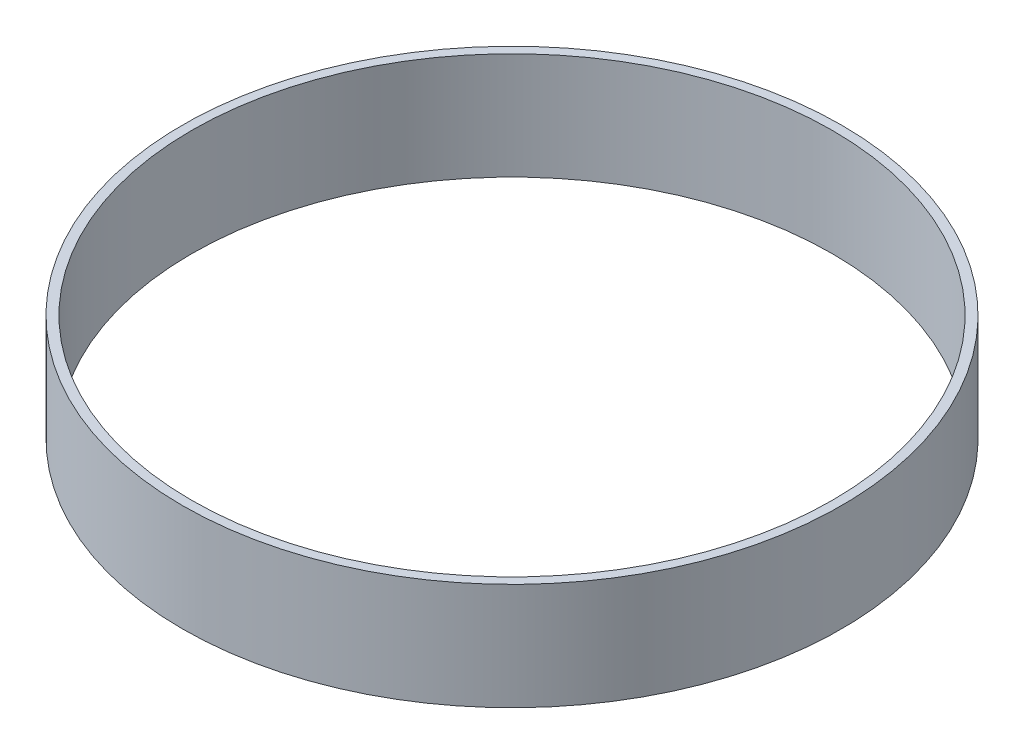
ISO-10303-21;
HEADER;
FILE_DESCRIPTION(('STEP AP214'),'2;1');
FILE_NAME('part.step','',(''),(''),'','','');
FILE_SCHEMA(('AUTOMOTIVE_DESIGN { 1 0 10303 214 1 1 1 1 }'));
ENDSEC;
DATA;
#1=APPLICATION_CONTEXT('core data for automotive mechanical design processes');
#2=APPLICATION_PROTOCOL_DEFINITION('international standard','automotive_design',2000,#1);
#3=PRODUCT_CONTEXT('',#1,'mechanical');
#4=PRODUCT('Part','Part','',(#3));
#5=PRODUCT_RELATED_PRODUCT_CATEGORY('part','',(#4));
#6=PRODUCT_DEFINITION_FORMATION('','',#4);
#7=PRODUCT_DEFINITION_CONTEXT('part definition',#1,'design');
#8=PRODUCT_DEFINITION('design','',#6,#7);
#9=PRODUCT_DEFINITION_SHAPE('','',#8);
#10=(LENGTH_UNIT() NAMED_UNIT(*) SI_UNIT(.MILLI.,.METRE.));
#11=(NAMED_UNIT(*) PLANE_ANGLE_UNIT() SI_UNIT($,.RADIAN.));
#12=(NAMED_UNIT(*) SI_UNIT($,.STERADIAN.) SOLID_ANGLE_UNIT());
#13=UNCERTAINTY_MEASURE_WITH_UNIT(LENGTH_MEASURE(1.E-05),#10,'distance_accuracy_value','');
#14=(GEOMETRIC_REPRESENTATION_CONTEXT(3) GLOBAL_UNCERTAINTY_ASSIGNED_CONTEXT((#13)) GLOBAL_UNIT_ASSIGNED_CONTEXT((#10,
#11,#12)) REPRESENTATION_CONTEXT('',''));
#15=CARTESIAN_POINT('',(0.,0.,0.));
#16=DIRECTION('',(0.,0.,1.));
#17=DIRECTION('',(1.,0.,0.));
#18=AXIS2_PLACEMENT_3D('',#15,#16,#17);
#19=CARTESIAN_POINT('',(0.,25.4,0.));
#20=DIRECTION('',(0.,1.,0.));
#21=DIRECTION('',(0.,0.,1.));
#22=AXIS2_PLACEMENT_3D('',#19,#20,#21);
#23=PLANE('',#22);
#24=CARTESIAN_POINT('',(0.,25.4,0.));
#25=DIRECTION('',(0.,1.,0.));
#26=DIRECTION('',(0.,0.,1.));
#27=AXIS2_PLACEMENT_3D('',#24,#25,#26);
#28=CIRCLE('',#27,78.359);
#29=CARTESIAN_POINT('',(0.,25.4,78.359));
#30=VERTEX_POINT('',#29);
#31=EDGE_CURVE('E10',#30,#30,#28,.T.);
#32=ORIENTED_EDGE('',*,*,#31,.T.);
#33=EDGE_LOOP('',(#32));
#34=FACE_BOUND('',#33,.T.);
#35=CARTESIAN_POINT('',(0.,25.4,0.));
#36=DIRECTION('',(0.,1.,0.));
#37=DIRECTION('',(0.,0.,1.));
#38=AXIS2_PLACEMENT_3D('',#35,#36,#37);
#39=CIRCLE('',#38,76.1746);
#40=CARTESIAN_POINT('',(0.,25.4,76.1746));
#41=VERTEX_POINT('',#40);
#42=EDGE_CURVE('E51',#41,#41,#39,.T.);
#43=ORIENTED_EDGE('',*,*,#42,.F.);
#44=EDGE_LOOP('',(#43));
#45=FACE_BOUND('',#44,.T.);
#46=ADVANCED_FACE('F37',(#34,#45),#23,.T.);
#47=CARTESIAN_POINT('',(0.,0.,0.));
#48=DIRECTION('',(0.,1.,0.));
#49=DIRECTION('',(0.,0.,1.));
#50=AXIS2_PLACEMENT_3D('',#47,#48,#49);
#51=PLANE('',#50);
#52=CARTESIAN_POINT('',(0.,0.,0.));
#53=DIRECTION('',(0.,1.,0.));
#54=DIRECTION('',(0.,0.,1.));
#55=AXIS2_PLACEMENT_3D('',#52,#53,#54);
#56=CIRCLE('',#55,78.359);
#57=CARTESIAN_POINT('',(0.,0.,78.359));
#58=VERTEX_POINT('',#57);
#59=EDGE_CURVE('E41',#58,#58,#56,.T.);
#60=ORIENTED_EDGE('',*,*,#59,.F.);
#61=EDGE_LOOP('',(#60));
#62=FACE_BOUND('',#61,.T.);
#63=CARTESIAN_POINT('',(0.,0.,0.));
#64=DIRECTION('',(0.,1.,0.));
#65=DIRECTION('',(0.,0.,1.));
#66=AXIS2_PLACEMENT_3D('',#63,#64,#65);
#67=CIRCLE('',#66,76.1746);
#68=CARTESIAN_POINT('',(0.,0.,76.1746));
#69=VERTEX_POINT('',#68);
#70=EDGE_CURVE('E53',#69,#69,#67,.T.);
#71=ORIENTED_EDGE('',*,*,#70,.T.);
#72=EDGE_LOOP('',(#71));
#73=FACE_BOUND('',#72,.T.);
#74=ADVANCED_FACE('F66',(#62,#73),#51,.F.);
#75=CARTESIAN_POINT('',(0.,25.4,0.));
#76=DIRECTION('',(0.,-1.,0.));
#77=DIRECTION('',(0.,0.,-1.));
#78=AXIS2_PLACEMENT_3D('',#75,#76,#77);
#79=CYLINDRICAL_SURFACE('',#78,78.359);
#80=ORIENTED_EDGE('',*,*,#31,.F.);
#81=EDGE_LOOP('',(#80));
#82=FACE_BOUND('',#81,.T.);
#83=ORIENTED_EDGE('',*,*,#59,.T.);
#84=EDGE_LOOP('',(#83));
#85=FACE_BOUND('',#84,.T.);
#86=ADVANCED_FACE('F39',(#82,#85),#79,.T.);
#87=CARTESIAN_POINT('',(0.,25.4,0.));
#88=DIRECTION('',(0.,-1.,0.));
#89=DIRECTION('',(0.,0.,-1.));
#90=AXIS2_PLACEMENT_3D('',#87,#88,#89);
#91=CYLINDRICAL_SURFACE('',#90,76.1746);
#92=ORIENTED_EDGE('',*,*,#42,.T.);
#93=EDGE_LOOP('',(#92));
#94=FACE_BOUND('',#93,.T.);
#95=ORIENTED_EDGE('',*,*,#70,.F.);
#96=EDGE_LOOP('',(#95));
#97=FACE_BOUND('',#96,.T.);
#98=ADVANCED_FACE('F62',(#94,#97),#91,.F.);
#99=CLOSED_SHELL('',(#46,#74,#86,#98));
#100=MANIFOLD_SOLID_BREP('B2',#99);
#101=ADVANCED_BREP_SHAPE_REPRESENTATION('',(#18,#100),#14);
#102=SHAPE_DEFINITION_REPRESENTATION(#9,#101);
ENDSEC;
END-ISO-10303-21;
